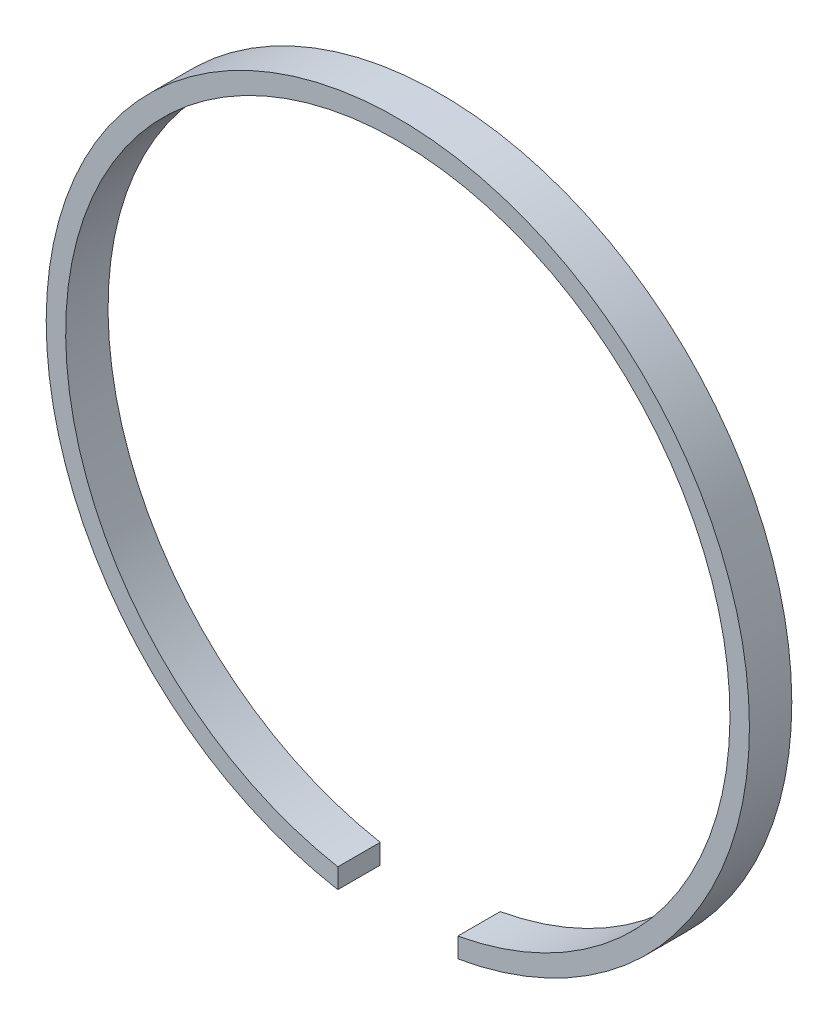
ISO-10303-21;
HEADER;
FILE_DESCRIPTION(('STEP AP214'),'2;1');
FILE_NAME('part.step','',(''),(''),'','','');
FILE_SCHEMA(('AUTOMOTIVE_DESIGN { 1 0 10303 214 1 1 1 1 }'));
ENDSEC;
DATA;
#1=APPLICATION_CONTEXT('core data for automotive mechanical design processes');
#2=APPLICATION_PROTOCOL_DEFINITION('international standard','automotive_design',2000,#1);
#3=PRODUCT_CONTEXT('',#1,'mechanical');
#4=PRODUCT('Part','Part','',(#3));
#5=PRODUCT_RELATED_PRODUCT_CATEGORY('part','',(#4));
#6=PRODUCT_DEFINITION_FORMATION('','',#4);
#7=PRODUCT_DEFINITION_CONTEXT('part definition',#1,'design');
#8=PRODUCT_DEFINITION('design','',#6,#7);
#9=PRODUCT_DEFINITION_SHAPE('','',#8);
#10=(LENGTH_UNIT() NAMED_UNIT(*) SI_UNIT(.MILLI.,.METRE.));
#11=(NAMED_UNIT(*) PLANE_ANGLE_UNIT() SI_UNIT($,.RADIAN.));
#12=(NAMED_UNIT(*) SI_UNIT($,.STERADIAN.) SOLID_ANGLE_UNIT());
#13=UNCERTAINTY_MEASURE_WITH_UNIT(LENGTH_MEASURE(1.E-05),#10,'distance_accuracy_value','');
#14=(GEOMETRIC_REPRESENTATION_CONTEXT(3) GLOBAL_UNCERTAINTY_ASSIGNED_CONTEXT((#13)) GLOBAL_UNIT_ASSIGNED_CONTEXT((#10,
#11,#12)) REPRESENTATION_CONTEXT('',''));
#15=CARTESIAN_POINT('',(0.,0.,0.));
#16=DIRECTION('',(0.,0.,1.));
#17=DIRECTION('',(1.,0.,0.));
#18=AXIS2_PLACEMENT_3D('',#15,#16,#17);
#19=CARTESIAN_POINT('',(0.,0.,3.7));
#20=DIRECTION('',(0.,0.,1.));
#21=DIRECTION('',(1.,0.,0.));
#22=AXIS2_PLACEMENT_3D('',#19,#20,#21);
#23=PLANE('',#22);
#24=DIRECTION('',(0.,1.,0.));
#25=VECTOR('',#24,1.);
#26=CARTESIAN_POINT('',(5.23717371527444,0.,3.7));
#27=LINE('',#26,#25);
#28=CARTESIAN_POINT('',(5.23717371527444,-30.2499919252227,3.7));
#29=VERTEX_POINT('',#28);
#30=CARTESIAN_POINT('',(5.23717371527444,-28.5231837542032,3.7));
#31=VERTEX_POINT('',#30);
#32=EDGE_CURVE('E55',#29,#31,#27,.T.);
#33=ORIENTED_EDGE('',*,*,#32,.F.);
#34=CARTESIAN_POINT('',(0.,0.,3.7));
#35=DIRECTION('',(0.,0.,1.));
#36=DIRECTION('',(1.,0.,0.));
#37=AXIS2_PLACEMENT_3D('',#34,#35,#36);
#38=CIRCLE('',#37,30.7);
#39=CARTESIAN_POINT('',(-5.23717371527444,-30.2499919252227,3.7));
#40=VERTEX_POINT('',#39);
#41=EDGE_CURVE('E78',#29,#40,#38,.T.);
#42=ORIENTED_EDGE('',*,*,#41,.T.);
#43=DIRECTION('',(0.,-1.,0.));
#44=VECTOR('',#43,1.);
#45=CARTESIAN_POINT('',(-5.23717371527444,0.,3.7));
#46=LINE('',#45,#44);
#47=CARTESIAN_POINT('',(-5.23717371527444,-28.5231837542032,3.7));
#48=VERTEX_POINT('',#47);
#49=EDGE_CURVE('E72',#48,#40,#46,.T.);
#50=ORIENTED_EDGE('',*,*,#49,.F.);
#51=CARTESIAN_POINT('',(0.,0.,3.7));
#52=DIRECTION('',(0.,0.,1.));
#53=DIRECTION('',(1.,0.,0.));
#54=AXIS2_PLACEMENT_3D('',#51,#52,#53);
#55=CIRCLE('',#54,29.);
#56=EDGE_CURVE('E82',#31,#48,#55,.T.);
#57=ORIENTED_EDGE('',*,*,#56,.F.);
#58=EDGE_LOOP('',(#33,#42,#50,#57));
#59=FACE_BOUND('',#58,.T.);
#60=ADVANCED_FACE('F33',(#59),#23,.T.);
#61=CARTESIAN_POINT('',(0.,0.,0.));
#62=DIRECTION('',(0.,0.,1.));
#63=DIRECTION('',(1.,0.,0.));
#64=AXIS2_PLACEMENT_3D('',#61,#62,#63);
#65=PLANE('',#64);
#66=CARTESIAN_POINT('',(0.,0.,0.));
#67=DIRECTION('',(0.,0.,1.));
#68=DIRECTION('',(1.,0.,0.));
#69=AXIS2_PLACEMENT_3D('',#66,#67,#68);
#70=CIRCLE('',#69,30.7);
#71=CARTESIAN_POINT('',(5.23717371527444,-30.2499919252227,0.));
#72=VERTEX_POINT('',#71);
#73=CARTESIAN_POINT('',(-5.23717371527444,-30.2499919252227,0.));
#74=VERTEX_POINT('',#73);
#75=EDGE_CURVE('E87',#72,#74,#70,.T.);
#76=ORIENTED_EDGE('',*,*,#75,.F.);
#77=DIRECTION('',(0.,1.,0.));
#78=VECTOR('',#77,1.);
#79=CARTESIAN_POINT('',(5.23717371527444,0.,0.));
#80=LINE('',#79,#78);
#81=CARTESIAN_POINT('',(5.23717371527444,-28.5231837542032,0.));
#82=VERTEX_POINT('',#81);
#83=EDGE_CURVE('E99',#72,#82,#80,.T.);
#84=ORIENTED_EDGE('',*,*,#83,.T.);
#85=CARTESIAN_POINT('',(0.,0.,0.));
#86=DIRECTION('',(0.,0.,1.));
#87=DIRECTION('',(1.,0.,0.));
#88=AXIS2_PLACEMENT_3D('',#85,#86,#87);
#89=CIRCLE('',#88,29.);
#90=CARTESIAN_POINT('',(-5.23717371527444,-28.5231837542032,0.));
#91=VERTEX_POINT('',#90);
#92=EDGE_CURVE('E88',#82,#91,#89,.T.);
#93=ORIENTED_EDGE('',*,*,#92,.T.);
#94=DIRECTION('',(0.,-1.,0.));
#95=VECTOR('',#94,1.);
#96=CARTESIAN_POINT('',(-5.23717371527444,0.,0.));
#97=LINE('',#96,#95);
#98=EDGE_CURVE('E48',#91,#74,#97,.T.);
#99=ORIENTED_EDGE('',*,*,#98,.T.);
#100=EDGE_LOOP('',(#76,#84,#93,#99));
#101=FACE_BOUND('',#100,.T.);
#102=ADVANCED_FACE('F105',(#101),#65,.F.);
#103=CARTESIAN_POINT('',(0.,0.,3.7));
#104=DIRECTION('',(0.,0.,-1.));
#105=DIRECTION('',(-1.,0.,0.));
#106=AXIS2_PLACEMENT_3D('',#103,#104,#105);
#107=CYLINDRICAL_SURFACE('',#106,30.7);
#108=ORIENTED_EDGE('',*,*,#41,.F.);
#109=DIRECTION('',(0.,0.,-1.));
#110=VECTOR('',#109,1.);
#111=CARTESIAN_POINT('',(5.23717371527444,-30.2499919252227,3.7));
#112=LINE('',#111,#110);
#113=EDGE_CURVE('E92',#29,#72,#112,.T.);
#114=ORIENTED_EDGE('',*,*,#113,.T.);
#115=ORIENTED_EDGE('',*,*,#75,.T.);
#116=DIRECTION('',(0.,0.,-1.));
#117=VECTOR('',#116,1.);
#118=CARTESIAN_POINT('',(-5.23717371527444,-30.2499919252227,3.7));
#119=LINE('',#118,#117);
#120=EDGE_CURVE('E84',#74,#40,#119,.F.);
#121=ORIENTED_EDGE('',*,*,#120,.T.);
#122=EDGE_LOOP('',(#108,#114,#115,#121));
#123=FACE_BOUND('',#122,.T.);
#124=ADVANCED_FACE('F35',(#123),#107,.T.);
#125=CARTESIAN_POINT('',(0.,0.,3.7));
#126=DIRECTION('',(0.,0.,-1.));
#127=DIRECTION('',(-1.,0.,0.));
#128=AXIS2_PLACEMENT_3D('',#125,#126,#127);
#129=CYLINDRICAL_SURFACE('',#128,29.);
#130=DIRECTION('',(0.,0.,-1.));
#131=VECTOR('',#130,1.);
#132=CARTESIAN_POINT('',(5.23717371527444,-28.5231837542032,3.7));
#133=LINE('',#132,#131);
#134=EDGE_CURVE('E11',#31,#82,#133,.T.);
#135=ORIENTED_EDGE('',*,*,#134,.F.);
#136=ORIENTED_EDGE('',*,*,#56,.T.);
#137=DIRECTION('',(0.,0.,-1.));
#138=VECTOR('',#137,1.);
#139=CARTESIAN_POINT('',(-5.23717371527444,-28.5231837542032,3.7));
#140=LINE('',#139,#138);
#141=EDGE_CURVE('E41',#91,#48,#140,.F.);
#142=ORIENTED_EDGE('',*,*,#141,.F.);
#143=ORIENTED_EDGE('',*,*,#92,.F.);
#144=EDGE_LOOP('',(#135,#136,#142,#143));
#145=FACE_BOUND('',#144,.T.);
#146=ADVANCED_FACE('F86',(#145),#129,.F.);
#147=CARTESIAN_POINT('',(-5.23717371527444,-58.,-10.3498009272691));
#148=DIRECTION('',(-1.,0.,0.));
#149=DIRECTION('',(0.,0.,1.));
#150=AXIS2_PLACEMENT_3D('',#147,#148,#149);
#151=PLANE('',#150);
#152=ORIENTED_EDGE('',*,*,#98,.F.);
#153=ORIENTED_EDGE('',*,*,#141,.T.);
#154=ORIENTED_EDGE('',*,*,#49,.T.);
#155=ORIENTED_EDGE('',*,*,#120,.F.);
#156=EDGE_LOOP('',(#152,#153,#154,#155));
#157=FACE_BOUND('',#156,.T.);
#158=ADVANCED_FACE('F71',(#157),#151,.F.);
#159=CARTESIAN_POINT('',(5.23717371527444,-58.,-10.3498009272691));
#160=DIRECTION('',(1.,0.,0.));
#161=DIRECTION('',(0.,0.,-1.));
#162=AXIS2_PLACEMENT_3D('',#159,#160,#161);
#163=PLANE('',#162);
#164=ORIENTED_EDGE('',*,*,#32,.T.);
#165=ORIENTED_EDGE('',*,*,#134,.T.);
#166=ORIENTED_EDGE('',*,*,#83,.F.);
#167=ORIENTED_EDGE('',*,*,#113,.F.);
#168=EDGE_LOOP('',(#164,#165,#166,#167));
#169=FACE_BOUND('',#168,.T.);
#170=ADVANCED_FACE('F107',(#169),#163,.F.);
#171=CLOSED_SHELL('',(#60,#102,#124,#146,#158,#170));
#172=MANIFOLD_SOLID_BREP('B2',#171);
#173=ADVANCED_BREP_SHAPE_REPRESENTATION('',(#18,#172),#14);
#174=SHAPE_DEFINITION_REPRESENTATION(#9,#173);
ENDSEC;
END-ISO-10303-21;
